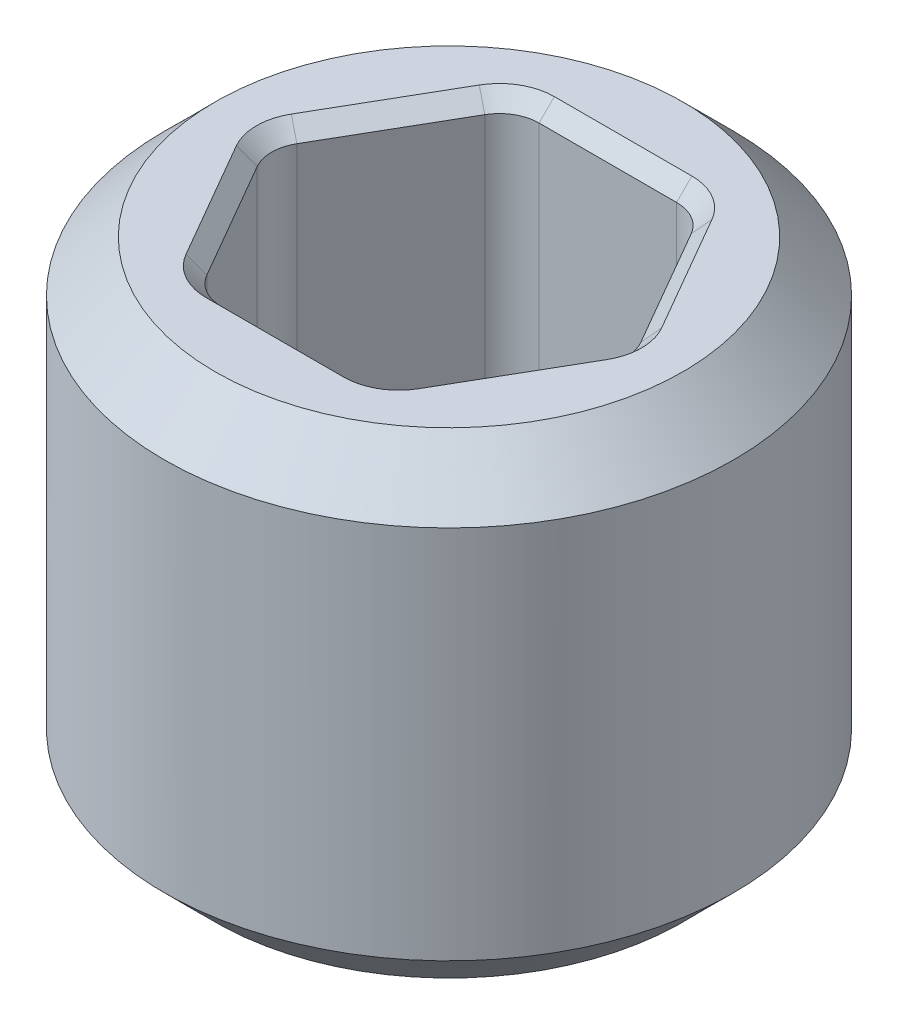
ISO-10303-21;
HEADER;
FILE_DESCRIPTION(('STEP AP214'),'2;1');
FILE_NAME('part.step','',(''),(''),'','','');
FILE_SCHEMA(('AUTOMOTIVE_DESIGN { 1 0 10303 214 1 1 1 1 }'));
ENDSEC;
DATA;
#1=APPLICATION_CONTEXT('core data for automotive mechanical design processes');
#2=APPLICATION_PROTOCOL_DEFINITION('international standard','automotive_design',2000,#1);
#3=PRODUCT_CONTEXT('',#1,'mechanical');
#4=PRODUCT('Part','Part','',(#3));
#5=PRODUCT_RELATED_PRODUCT_CATEGORY('part','',(#4));
#6=PRODUCT_DEFINITION_FORMATION('','',#4);
#7=PRODUCT_DEFINITION_CONTEXT('part definition',#1,'design');
#8=PRODUCT_DEFINITION('design','',#6,#7);
#9=PRODUCT_DEFINITION_SHAPE('','',#8);
#10=(LENGTH_UNIT() NAMED_UNIT(*) SI_UNIT(.MILLI.,.METRE.));
#11=(NAMED_UNIT(*) PLANE_ANGLE_UNIT() SI_UNIT($,.RADIAN.));
#12=(NAMED_UNIT(*) SI_UNIT($,.STERADIAN.) SOLID_ANGLE_UNIT());
#13=UNCERTAINTY_MEASURE_WITH_UNIT(LENGTH_MEASURE(1.E-05),#10,'distance_accuracy_value','');
#14=(GEOMETRIC_REPRESENTATION_CONTEXT(3) GLOBAL_UNCERTAINTY_ASSIGNED_CONTEXT((#13)) GLOBAL_UNIT_ASSIGNED_CONTEXT((#10,
#11,#12)) REPRESENTATION_CONTEXT('',''));
#15=CARTESIAN_POINT('',(0.,0.,0.));
#16=DIRECTION('',(0.,0.,1.));
#17=DIRECTION('',(1.,0.,0.));
#18=AXIS2_PLACEMENT_3D('',#15,#16,#17);
#19=CARTESIAN_POINT('',(0.,-1.190625,0.));
#20=DIRECTION('',(0.,-1.,0.));
#21=DIRECTION('',(0.,0.,-1.));
#22=AXIS2_PLACEMENT_3D('',#19,#20,#21);
#23=PLANE('',#22);
#24=CARTESIAN_POINT('',(0.343703832126949,-1.190625,0.5953125));
#25=DIRECTION('',(0.,-1.,0.));
#26=DIRECTION('',(0.,0.,-1.));
#27=AXIS2_PLACEMENT_3D('',#24,#25,#26);
#28=CIRCLE('',#27,0.274637500000001);
#29=CARTESIAN_POINT('',(0.343703832126949,-1.190625,0.869950000000001));
#30=VERTEX_POINT('',#29);
#31=CARTESIAN_POINT('',(0.581546883958799,-1.190625,0.73263125));
#32=VERTEX_POINT('',#31);
#33=EDGE_CURVE('E429',#30,#32,#28,.F.);
#34=ORIENTED_EDGE('',*,*,#33,.T.);
#35=DIRECTION('',(0.499999999999999,0.,-0.866025403784439));
#36=VECTOR('',#35,1.);
#37=CARTESIAN_POINT('',(0.925250716085747,-1.190625,0.137318749999999));
#38=LINE('',#37,#36);
#39=CARTESIAN_POINT('',(0.925250716085747,-1.190625,0.13731875));
#40=VERTEX_POINT('',#39);
#41=EDGE_CURVE('E433',#32,#40,#38,.T.);
#42=ORIENTED_EDGE('',*,*,#41,.T.);
#43=CARTESIAN_POINT('',(0.687407664253898,-1.190625,0.));
#44=DIRECTION('',(0.,-1.,0.));
#45=DIRECTION('',(0.,0.,-1.));
#46=AXIS2_PLACEMENT_3D('',#43,#44,#45);
#47=CIRCLE('',#46,0.274637500000001);
#48=CARTESIAN_POINT('',(0.925250716085747,-1.190625,-0.137318750000001));
#49=VERTEX_POINT('',#48);
#50=EDGE_CURVE('E431',#40,#49,#47,.F.);
#51=ORIENTED_EDGE('',*,*,#50,.T.);
#52=DIRECTION('',(-0.5,0.,-0.866025403784439));
#53=VECTOR('',#52,1.);
#54=CARTESIAN_POINT('',(0.581546883958798,-1.190625,-0.732631250000001));
#55=LINE('',#54,#53);
#56=CARTESIAN_POINT('',(0.581546883958798,-1.190625,-0.732631250000001));
#57=VERTEX_POINT('',#56);
#58=EDGE_CURVE('E427',#49,#57,#55,.T.);
#59=ORIENTED_EDGE('',*,*,#58,.T.);
#60=CARTESIAN_POINT('',(0.343703832126949,-1.190625,-0.5953125));
#61=DIRECTION('',(0.,-1.,0.));
#62=DIRECTION('',(0.,0.,-1.));
#63=AXIS2_PLACEMENT_3D('',#60,#61,#62);
#64=CIRCLE('',#63,0.274637500000001);
#65=CARTESIAN_POINT('',(0.343703832126949,-1.190625,-0.869950000000001));
#66=VERTEX_POINT('',#65);
#67=EDGE_CURVE('E419',#57,#66,#64,.F.);
#68=ORIENTED_EDGE('',*,*,#67,.T.);
#69=DIRECTION('',(-1.,0.,0.));
#70=VECTOR('',#69,1.);
#71=CARTESIAN_POINT('',(-0.343703832126949,-1.190625,-0.869950000000001));
#72=LINE('',#71,#70);
#73=CARTESIAN_POINT('',(-0.343703832126949,-1.190625,-0.869950000000001));
#74=VERTEX_POINT('',#73);
#75=EDGE_CURVE('E201',#66,#74,#72,.T.);
#76=ORIENTED_EDGE('',*,*,#75,.T.);
#77=CARTESIAN_POINT('',(-0.343703832126949,-1.190625,-0.5953125));
#78=DIRECTION('',(0.,-1.,0.));
#79=DIRECTION('',(0.,0.,-1.));
#80=AXIS2_PLACEMENT_3D('',#77,#78,#79);
#81=CIRCLE('',#80,0.274637500000001);
#82=CARTESIAN_POINT('',(-0.581546883958799,-1.190625,-0.73263125));
#83=VERTEX_POINT('',#82);
#84=EDGE_CURVE('E195',#74,#83,#81,.F.);
#85=ORIENTED_EDGE('',*,*,#84,.T.);
#86=DIRECTION('',(-0.499999999999999,0.,0.866025403784439));
#87=VECTOR('',#86,1.);
#88=CARTESIAN_POINT('',(-0.925250716085747,-1.190625,-0.13731875));
#89=LINE('',#88,#87);
#90=CARTESIAN_POINT('',(-0.925250716085747,-1.190625,-0.13731875));
#91=VERTEX_POINT('',#90);
#92=EDGE_CURVE('E198',#83,#91,#89,.T.);
#93=ORIENTED_EDGE('',*,*,#92,.T.);
#94=CARTESIAN_POINT('',(-0.687407664253898,-1.190625,0.));
#95=DIRECTION('',(0.,-1.,0.));
#96=DIRECTION('',(0.,0.,-1.));
#97=AXIS2_PLACEMENT_3D('',#94,#95,#96);
#98=CIRCLE('',#97,0.274637500000001);
#99=CARTESIAN_POINT('',(-0.925250716085747,-1.190625,0.137318750000001));
#100=VERTEX_POINT('',#99);
#101=EDGE_CURVE('E207',#91,#100,#98,.F.);
#102=ORIENTED_EDGE('',*,*,#101,.T.);
#103=DIRECTION('',(0.500000000000001,0.,0.866025403784438));
#104=VECTOR('',#103,1.);
#105=CARTESIAN_POINT('',(-0.581546883958798,-1.190625,0.732631250000001));
#106=LINE('',#105,#104);
#107=CARTESIAN_POINT('',(-0.581546883958798,-1.190625,0.732631250000001));
#108=VERTEX_POINT('',#107);
#109=EDGE_CURVE('E206',#100,#108,#106,.T.);
#110=ORIENTED_EDGE('',*,*,#109,.T.);
#111=CARTESIAN_POINT('',(-0.343703832126948,-1.190625,0.5953125));
#112=DIRECTION('',(0.,-1.,0.));
#113=DIRECTION('',(0.,0.,-1.));
#114=AXIS2_PLACEMENT_3D('',#111,#112,#113);
#115=CIRCLE('',#114,0.274637500000001);
#116=CARTESIAN_POINT('',(-0.343703832126948,-1.190625,0.869950000000001));
#117=VERTEX_POINT('',#116);
#118=EDGE_CURVE('E417',#108,#117,#115,.F.);
#119=ORIENTED_EDGE('',*,*,#118,.T.);
#120=DIRECTION('',(1.,0.,0.));
#121=VECTOR('',#120,1.);
#122=CARTESIAN_POINT('',(0.343703832126949,-1.190625,0.869950000000001));
#123=LINE('',#122,#121);
#124=EDGE_CURVE('E421',#117,#30,#123,.T.);
#125=ORIENTED_EDGE('',*,*,#124,.T.);
#126=EDGE_LOOP('',(#34,#42,#51,#59,#68,#76,#85,#93,#102,#110,#119,#125));
#127=FACE_BOUND('',#126,.T.);
#128=CARTESIAN_POINT('',(0.,-1.190625,0.));
#129=DIRECTION('',(0.,-1.,0.));
#130=DIRECTION('',(0.,0.,-1.));
#131=AXIS2_PLACEMENT_3D('',#128,#129,#130);
#132=CIRCLE('',#131,1.1684);
#133=CARTESIAN_POINT('',(0.,-1.190625,-1.1684));
#134=VERTEX_POINT('',#133);
#135=EDGE_CURVE('E463',#134,#134,#132,.T.);
#136=ORIENTED_EDGE('',*,*,#135,.T.);
#137=EDGE_LOOP('',(#136));
#138=FACE_BOUND('',#137,.T.);
#139=ADVANCED_FACE('F33',(#127,#138),#23,.T.);
#140=CARTESIAN_POINT('',(0.,-1.70416602917091,0.));
#141=DIRECTION('',(0.,-1.,0.));
#142=DIRECTION('',(0.,0.,-1.));
#143=AXIS2_PLACEMENT_3D('',#140,#141,#142);
#144=CYLINDRICAL_SURFACE('',#143,1.4224);
#145=CARTESIAN_POINT('',(0.,-0.936625000000001,0.));
#146=DIRECTION('',(0.,-1.,0.));
#147=DIRECTION('',(0.,0.,-1.));
#148=AXIS2_PLACEMENT_3D('',#145,#146,#147);
#149=CIRCLE('',#148,1.4224);
#150=CARTESIAN_POINT('',(0.,-0.936625000000001,-1.4224));
#151=VERTEX_POINT('',#150);
#152=EDGE_CURVE('E469',#151,#151,#149,.F.);
#153=ORIENTED_EDGE('',*,*,#152,.T.);
#154=EDGE_LOOP('',(#153));
#155=FACE_BOUND('',#154,.T.);
#156=CARTESIAN_POINT('',(0.,0.936625000000001,0.));
#157=DIRECTION('',(0.,1.,0.));
#158=DIRECTION('',(0.,0.,1.));
#159=AXIS2_PLACEMENT_3D('',#156,#157,#158);
#160=CIRCLE('',#159,1.4224);
#161=CARTESIAN_POINT('',(0.,0.936625000000001,1.4224));
#162=VERTEX_POINT('',#161);
#163=EDGE_CURVE('E466',#162,#162,#160,.F.);
#164=ORIENTED_EDGE('',*,*,#163,.T.);
#165=EDGE_LOOP('',(#164));
#166=FACE_BOUND('',#165,.T.);
#167=ADVANCED_FACE('F552',(#155,#166),#144,.T.);
#168=CARTESIAN_POINT('',(1.4224,1.190625,0.));
#169=DIRECTION('',(0.,1.,0.));
#170=DIRECTION('',(0.,0.,1.));
#171=AXIS2_PLACEMENT_3D('',#168,#169,#170);
#172=PLANE('',#171);
#173=CARTESIAN_POINT('',(0.343703832126949,1.190625,-0.5953125));
#174=DIRECTION('',(0.,1.,0.));
#175=DIRECTION('',(0.,0.,1.));
#176=AXIS2_PLACEMENT_3D('',#173,#174,#175);
#177=CIRCLE('',#176,0.274637500000001);
#178=CARTESIAN_POINT('',(0.343703832126949,1.190625,-0.86995));
#179=VERTEX_POINT('',#178);
#180=CARTESIAN_POINT('',(0.581546883958798,1.190625,-0.73263125));
#181=VERTEX_POINT('',#180);
#182=EDGE_CURVE('E42',#179,#181,#177,.F.);
#183=ORIENTED_EDGE('',*,*,#182,.T.);
#184=DIRECTION('',(0.5,0.,0.866025403784439));
#185=VECTOR('',#184,1.);
#186=CARTESIAN_POINT('',(0.925250716085747,1.190625,-0.137318750000001));
#187=LINE('',#186,#185);
#188=CARTESIAN_POINT('',(0.925250716085747,1.190625,-0.137318750000001));
#189=VERTEX_POINT('',#188);
#190=EDGE_CURVE('E11',#181,#189,#187,.T.);
#191=ORIENTED_EDGE('',*,*,#190,.T.);
#192=CARTESIAN_POINT('',(0.687407664253898,1.190625,0.));
#193=DIRECTION('',(0.,1.,0.));
#194=DIRECTION('',(0.,0.,1.));
#195=AXIS2_PLACEMENT_3D('',#192,#193,#194);
#196=CIRCLE('',#195,0.2746375);
#197=CARTESIAN_POINT('',(0.925250716085747,1.190625,0.137318749999999));
#198=VERTEX_POINT('',#197);
#199=EDGE_CURVE('E345',#189,#198,#196,.F.);
#200=ORIENTED_EDGE('',*,*,#199,.T.);
#201=DIRECTION('',(-0.499999999999999,0.,0.866025403784439));
#202=VECTOR('',#201,1.);
#203=CARTESIAN_POINT('',(0.581546883958798,1.190625,0.73263125));
#204=LINE('',#203,#202);
#205=CARTESIAN_POINT('',(0.581546883958798,1.190625,0.73263125));
#206=VERTEX_POINT('',#205);
#207=EDGE_CURVE('E341',#198,#206,#204,.T.);
#208=ORIENTED_EDGE('',*,*,#207,.T.);
#209=CARTESIAN_POINT('',(0.343703832126949,1.190625,0.5953125));
#210=DIRECTION('',(0.,1.,0.));
#211=DIRECTION('',(0.,0.,1.));
#212=AXIS2_PLACEMENT_3D('',#209,#210,#211);
#213=CIRCLE('',#212,0.2746375);
#214=CARTESIAN_POINT('',(0.343703832126949,1.190625,0.86995));
#215=VERTEX_POINT('',#214);
#216=EDGE_CURVE('E337',#206,#215,#213,.F.);
#217=ORIENTED_EDGE('',*,*,#216,.T.);
#218=DIRECTION('',(-1.,0.,0.));
#219=VECTOR('',#218,1.);
#220=CARTESIAN_POINT('',(-0.343703832126948,1.190625,0.86995));
#221=LINE('',#220,#219);
#222=CARTESIAN_POINT('',(-0.343703832126948,1.190625,0.869950000000001));
#223=VERTEX_POINT('',#222);
#224=EDGE_CURVE('E333',#215,#223,#221,.T.);
#225=ORIENTED_EDGE('',*,*,#224,.T.);
#226=CARTESIAN_POINT('',(-0.343703832126948,1.190625,0.5953125));
#227=DIRECTION('',(0.,1.,0.));
#228=DIRECTION('',(0.,0.,1.));
#229=AXIS2_PLACEMENT_3D('',#226,#227,#228);
#230=CIRCLE('',#229,0.2746375);
#231=CARTESIAN_POINT('',(-0.581546883958797,1.190625,0.73263125));
#232=VERTEX_POINT('',#231);
#233=EDGE_CURVE('E329',#223,#232,#230,.F.);
#234=ORIENTED_EDGE('',*,*,#233,.T.);
#235=DIRECTION('',(-0.500000000000001,0.,-0.866025403784438));
#236=VECTOR('',#235,1.);
#237=CARTESIAN_POINT('',(-0.925250716085746,1.190625,0.137318750000001));
#238=LINE('',#237,#236);
#239=CARTESIAN_POINT('',(-0.925250716085746,1.190625,0.137318750000001));
#240=VERTEX_POINT('',#239);
#241=EDGE_CURVE('E327',#232,#240,#238,.T.);
#242=ORIENTED_EDGE('',*,*,#241,.T.);
#243=CARTESIAN_POINT('',(-0.687407664253898,1.190625,0.));
#244=DIRECTION('',(0.,1.,0.));
#245=DIRECTION('',(0.,0.,1.));
#246=AXIS2_PLACEMENT_3D('',#243,#244,#245);
#247=CIRCLE('',#246,0.2746375);
#248=CARTESIAN_POINT('',(-0.925250716085747,1.190625,-0.13731875));
#249=VERTEX_POINT('',#248);
#250=EDGE_CURVE('E331',#240,#249,#247,.F.);
#251=ORIENTED_EDGE('',*,*,#250,.T.);
#252=DIRECTION('',(0.499999999999999,0.,-0.866025403784439));
#253=VECTOR('',#252,1.);
#254=CARTESIAN_POINT('',(-0.581546883958799,1.190625,-0.73263125));
#255=LINE('',#254,#253);
#256=CARTESIAN_POINT('',(-0.581546883958799,1.190625,-0.73263125));
#257=VERTEX_POINT('',#256);
#258=EDGE_CURVE('E335',#249,#257,#255,.T.);
#259=ORIENTED_EDGE('',*,*,#258,.T.);
#260=CARTESIAN_POINT('',(-0.343703832126949,1.190625,-0.5953125));
#261=DIRECTION('',(0.,1.,0.));
#262=DIRECTION('',(0.,0.,1.));
#263=AXIS2_PLACEMENT_3D('',#260,#261,#262);
#264=CIRCLE('',#263,0.2746375);
#265=CARTESIAN_POINT('',(-0.343703832126949,1.190625,-0.869950000000001));
#266=VERTEX_POINT('',#265);
#267=EDGE_CURVE('E339',#257,#266,#264,.F.);
#268=ORIENTED_EDGE('',*,*,#267,.T.);
#269=DIRECTION('',(1.,0.,0.));
#270=VECTOR('',#269,1.);
#271=CARTESIAN_POINT('',(0.343703832126949,1.190625,-0.86995));
#272=LINE('',#271,#270);
#273=EDGE_CURVE('E343',#266,#179,#272,.T.);
#274=ORIENTED_EDGE('',*,*,#273,.T.);
#275=EDGE_LOOP('',(#183,#191,#200,#208,#217,#225,#234,#242,#251,#259,#268,#274));
#276=FACE_BOUND('',#275,.T.);
#277=CARTESIAN_POINT('',(0.,1.190625,0.));
#278=DIRECTION('',(0.,1.,0.));
#279=DIRECTION('',(0.,0.,1.));
#280=AXIS2_PLACEMENT_3D('',#277,#278,#279);
#281=CIRCLE('',#280,1.1684);
#282=CARTESIAN_POINT('',(0.,1.190625,1.1684));
#283=VERTEX_POINT('',#282);
#284=EDGE_CURVE('E218',#283,#283,#281,.T.);
#285=ORIENTED_EDGE('',*,*,#284,.T.);
#286=EDGE_LOOP('',(#285));
#287=FACE_BOUND('',#286,.T.);
#288=ADVANCED_FACE('F347',(#276,#287),#172,.T.);
#289=CARTESIAN_POINT('',(0.91654355233853,-1.190625,0.));
#290=DIRECTION('',(0.866025403784438,0.,-0.5));
#291=DIRECTION('',(-0.5,0.,-0.866025403784438));
#292=AXIS2_PLACEMENT_3D('',#289,#290,#291);
#293=PLANE('',#292);
#294=DIRECTION('',(0.,1.,0.));
#295=VECTOR('',#294,1.);
#296=CARTESIAN_POINT('',(0.515555748190423,-1.190625,-0.69453125));
#297=LINE('',#296,#295);
#298=CARTESIAN_POINT('',(0.515555748190423,1.114425,-0.69453125));
#299=VERTEX_POINT('',#298);
#300=CARTESIAN_POINT('',(0.515555748190423,-1.114425,-0.69453125));
#301=VERTEX_POINT('',#300);
#302=EDGE_CURVE('E224',#299,#301,#297,.F.);
#303=ORIENTED_EDGE('',*,*,#302,.T.);
#304=DIRECTION('',(0.5,0.,0.866025403784438));
#305=VECTOR('',#304,1.);
#306=CARTESIAN_POINT('',(0.859259580317372,-1.114425,-0.0992187500000005));
#307=LINE('',#306,#305);
#308=CARTESIAN_POINT('',(0.859259580317372,-1.114425,-0.0992187500000006));
#309=VERTEX_POINT('',#308);
#310=EDGE_CURVE('E379',#301,#309,#307,.T.);
#311=ORIENTED_EDGE('',*,*,#310,.T.);
#312=DIRECTION('',(0.,1.,0.));
#313=VECTOR('',#312,1.);
#314=CARTESIAN_POINT('',(0.859259580317372,1.190625,-0.0992187500000006));
#315=LINE('',#314,#313);
#316=CARTESIAN_POINT('',(0.859259580317372,1.114425,-0.0992187500000006));
#317=VERTEX_POINT('',#316);
#318=EDGE_CURVE('E447',#309,#317,#315,.T.);
#319=ORIENTED_EDGE('',*,*,#318,.T.);
#320=DIRECTION('',(-0.5,0.,-0.866025403784438));
#321=VECTOR('',#320,1.);
#322=CARTESIAN_POINT('',(0.515555748190423,1.114425,-0.69453125));
#323=LINE('',#322,#321);
#324=EDGE_CURVE('E376',#317,#299,#323,.T.);
#325=ORIENTED_EDGE('',*,*,#324,.T.);
#326=EDGE_LOOP('',(#303,#311,#319,#325));
#327=FACE_BOUND('',#326,.T.);
#328=ADVANCED_FACE('F531',(#327),#293,.F.);
#329=CARTESIAN_POINT('',(0.458271776169266,-1.190625,0.79375));
#330=DIRECTION('',(0.866025403784439,0.,0.499999999999999));
#331=DIRECTION('',(0.499999999999999,0.,-0.866025403784439));
#332=AXIS2_PLACEMENT_3D('',#329,#330,#331);
#333=PLANE('',#332);
#334=DIRECTION('',(0.,1.,0.));
#335=VECTOR('',#334,1.);
#336=CARTESIAN_POINT('',(0.859259580317372,-1.190625,0.0992187499999992));
#337=LINE('',#336,#335);
#338=CARTESIAN_POINT('',(0.859259580317372,1.114425,0.0992187499999992));
#339=VERTEX_POINT('',#338);
#340=CARTESIAN_POINT('',(0.859259580317372,-1.114425,0.0992187499999992));
#341=VERTEX_POINT('',#340);
#342=EDGE_CURVE('E439',#339,#341,#337,.F.);
#343=ORIENTED_EDGE('',*,*,#342,.T.);
#344=DIRECTION('',(-0.499999999999999,0.,0.866025403784439));
#345=VECTOR('',#344,1.);
#346=CARTESIAN_POINT('',(0.515555748190424,-1.114425,0.69453125));
#347=LINE('',#346,#345);
#348=CARTESIAN_POINT('',(0.515555748190424,-1.114425,0.69453125));
#349=VERTEX_POINT('',#348);
#350=EDGE_CURVE('E364',#341,#349,#347,.T.);
#351=ORIENTED_EDGE('',*,*,#350,.T.);
#352=DIRECTION('',(0.,1.,0.));
#353=VECTOR('',#352,1.);
#354=CARTESIAN_POINT('',(0.515555748190424,1.190625,0.69453125));
#355=LINE('',#354,#353);
#356=CARTESIAN_POINT('',(0.515555748190424,1.114425,0.69453125));
#357=VERTEX_POINT('',#356);
#358=EDGE_CURVE('E441',#349,#357,#355,.T.);
#359=ORIENTED_EDGE('',*,*,#358,.T.);
#360=DIRECTION('',(0.499999999999999,0.,-0.866025403784439));
#361=VECTOR('',#360,1.);
#362=CARTESIAN_POINT('',(0.859259580317372,1.114425,0.0992187499999991));
#363=LINE('',#362,#361);
#364=EDGE_CURVE('E369',#357,#339,#363,.T.);
#365=ORIENTED_EDGE('',*,*,#364,.T.);
#366=EDGE_LOOP('',(#343,#351,#359,#365));
#367=FACE_BOUND('',#366,.T.);
#368=ADVANCED_FACE('F438',(#367),#333,.F.);
#369=CARTESIAN_POINT('',(-0.458271776169265,-1.190625,0.79375));
#370=DIRECTION('',(0.,0.,1.));
#371=DIRECTION('',(1.,0.,0.));
#372=AXIS2_PLACEMENT_3D('',#369,#370,#371);
#373=PLANE('',#372);
#374=DIRECTION('',(0.,1.,0.));
#375=VECTOR('',#374,1.);
#376=CARTESIAN_POINT('',(0.343703832126949,-1.190625,0.79375));
#377=LINE('',#376,#375);
#378=CARTESIAN_POINT('',(0.343703832126949,1.114425,0.79375));
#379=VERTEX_POINT('',#378);
#380=CARTESIAN_POINT('',(0.343703832126949,-1.114425,0.79375));
#381=VERTEX_POINT('',#380);
#382=EDGE_CURVE('E445',#379,#381,#377,.F.);
#383=ORIENTED_EDGE('',*,*,#382,.T.);
#384=DIRECTION('',(-1.,0.,0.));
#385=VECTOR('',#384,1.);
#386=CARTESIAN_POINT('',(-0.343703832126948,-1.114425,0.79375));
#387=LINE('',#386,#385);
#388=CARTESIAN_POINT('',(-0.343703832126948,-1.114425,0.79375));
#389=VERTEX_POINT('',#388);
#390=EDGE_CURVE('E383',#381,#389,#387,.T.);
#391=ORIENTED_EDGE('',*,*,#390,.T.);
#392=DIRECTION('',(0.,1.,0.));
#393=VECTOR('',#392,1.);
#394=CARTESIAN_POINT('',(-0.343703832126948,1.190625,0.79375));
#395=LINE('',#394,#393);
#396=CARTESIAN_POINT('',(-0.343703832126948,1.114425,0.79375));
#397=VERTEX_POINT('',#396);
#398=EDGE_CURVE('E398',#389,#397,#395,.T.);
#399=ORIENTED_EDGE('',*,*,#398,.T.);
#400=DIRECTION('',(1.,0.,0.));
#401=VECTOR('',#400,1.);
#402=CARTESIAN_POINT('',(0.343703832126949,1.114425,0.79375));
#403=LINE('',#402,#401);
#404=EDGE_CURVE('E381',#397,#379,#403,.T.);
#405=ORIENTED_EDGE('',*,*,#404,.T.);
#406=EDGE_LOOP('',(#383,#391,#399,#405));
#407=FACE_BOUND('',#406,.T.);
#408=ADVANCED_FACE('F503',(#407),#373,.F.);
#409=CARTESIAN_POINT('',(-0.916543552338531,-1.190625,0.));
#410=DIRECTION('',(-0.866025403784438,0.,0.500000000000001));
#411=DIRECTION('',(0.500000000000001,0.,0.866025403784438));
#412=AXIS2_PLACEMENT_3D('',#409,#410,#411);
#413=PLANE('',#412);
#414=DIRECTION('',(0.,1.,0.));
#415=VECTOR('',#414,1.);
#416=CARTESIAN_POINT('',(-0.515555748190423,-1.190625,0.69453125));
#417=LINE('',#416,#415);
#418=CARTESIAN_POINT('',(-0.515555748190423,1.114425,0.69453125));
#419=VERTEX_POINT('',#418);
#420=CARTESIAN_POINT('',(-0.515555748190423,-1.114425,0.69453125));
#421=VERTEX_POINT('',#420);
#422=EDGE_CURVE('E396',#419,#421,#417,.F.);
#423=ORIENTED_EDGE('',*,*,#422,.T.);
#424=DIRECTION('',(-0.500000000000001,0.,-0.866025403784438));
#425=VECTOR('',#424,1.);
#426=CARTESIAN_POINT('',(-0.859259580317372,-1.114425,0.0992187500000006));
#427=LINE('',#426,#425);
#428=CARTESIAN_POINT('',(-0.859259580317372,-1.114425,0.0992187500000005));
#429=VERTEX_POINT('',#428);
#430=EDGE_CURVE('E309',#421,#429,#427,.T.);
#431=ORIENTED_EDGE('',*,*,#430,.T.);
#432=DIRECTION('',(0.,1.,0.));
#433=VECTOR('',#432,1.);
#434=CARTESIAN_POINT('',(-0.859259580317372,1.190625,0.0992187500000005));
#435=LINE('',#434,#433);
#436=CARTESIAN_POINT('',(-0.859259580317372,1.114425,0.0992187500000005));
#437=VERTEX_POINT('',#436);
#438=EDGE_CURVE('E408',#429,#437,#435,.T.);
#439=ORIENTED_EDGE('',*,*,#438,.T.);
#440=DIRECTION('',(0.500000000000001,0.,0.866025403784438));
#441=VECTOR('',#440,1.);
#442=CARTESIAN_POINT('',(-0.515555748190423,1.114425,0.69453125));
#443=LINE('',#442,#441);
#444=EDGE_CURVE('E306',#437,#419,#443,.T.);
#445=ORIENTED_EDGE('',*,*,#444,.T.);
#446=EDGE_LOOP('',(#423,#431,#439,#445));
#447=FACE_BOUND('',#446,.T.);
#448=ADVANCED_FACE('F403',(#447),#413,.F.);
#449=CARTESIAN_POINT('',(-0.458271776169266,-1.190625,-0.79375));
#450=DIRECTION('',(-0.866025403784439,0.,-0.499999999999999));
#451=DIRECTION('',(-0.499999999999999,0.,0.866025403784439));
#452=AXIS2_PLACEMENT_3D('',#449,#450,#451);
#453=PLANE('',#452);
#454=DIRECTION('',(0.,1.,0.));
#455=VECTOR('',#454,1.);
#456=CARTESIAN_POINT('',(-0.859259580317372,-1.190625,-0.0992187499999994));
#457=LINE('',#456,#455);
#458=CARTESIAN_POINT('',(-0.859259580317372,1.114425,-0.0992187499999994));
#459=VERTEX_POINT('',#458);
#460=CARTESIAN_POINT('',(-0.859259580317372,-1.114425,-0.0992187499999994));
#461=VERTEX_POINT('',#460);
#462=EDGE_CURVE('E456',#459,#461,#457,.F.);
#463=ORIENTED_EDGE('',*,*,#462,.T.);
#464=DIRECTION('',(0.499999999999999,0.,-0.866025403784439));
#465=VECTOR('',#464,1.);
#466=CARTESIAN_POINT('',(-0.515555748190424,-1.114425,-0.69453125));
#467=LINE('',#466,#465);
#468=CARTESIAN_POINT('',(-0.515555748190424,-1.114425,-0.69453125));
#469=VERTEX_POINT('',#468);
#470=EDGE_CURVE('E325',#461,#469,#467,.T.);
#471=ORIENTED_EDGE('',*,*,#470,.T.);
#472=DIRECTION('',(0.,1.,0.));
#473=VECTOR('',#472,1.);
#474=CARTESIAN_POINT('',(-0.515555748190424,1.190625,-0.69453125));
#475=LINE('',#474,#473);
#476=CARTESIAN_POINT('',(-0.515555748190424,1.114425,-0.69453125));
#477=VERTEX_POINT('',#476);
#478=EDGE_CURVE('E407',#469,#477,#475,.T.);
#479=ORIENTED_EDGE('',*,*,#478,.T.);
#480=DIRECTION('',(-0.499999999999999,0.,0.866025403784439));
#481=VECTOR('',#480,1.);
#482=CARTESIAN_POINT('',(-0.859259580317372,1.114425,-0.0992187499999993));
#483=LINE('',#482,#481);
#484=EDGE_CURVE('E323',#477,#459,#483,.T.);
#485=ORIENTED_EDGE('',*,*,#484,.T.);
#486=EDGE_LOOP('',(#463,#471,#479,#485));
#487=FACE_BOUND('',#486,.T.);
#488=ADVANCED_FACE('F481',(#487),#453,.F.);
#489=CARTESIAN_POINT('',(0.458271776169265,-1.190625,-0.79375));
#490=DIRECTION('',(0.,0.,-1.));
#491=DIRECTION('',(-1.,0.,0.));
#492=AXIS2_PLACEMENT_3D('',#489,#490,#491);
#493=PLANE('',#492);
#494=DIRECTION('',(0.,1.,0.));
#495=VECTOR('',#494,1.);
#496=CARTESIAN_POINT('',(-0.343703832126949,-1.190625,-0.79375));
#497=LINE('',#496,#495);
#498=CARTESIAN_POINT('',(-0.343703832126949,1.114425,-0.79375));
#499=VERTEX_POINT('',#498);
#500=CARTESIAN_POINT('',(-0.343703832126949,-1.114425,-0.79375));
#501=VERTEX_POINT('',#500);
#502=EDGE_CURVE('E461',#499,#501,#497,.F.);
#503=ORIENTED_EDGE('',*,*,#502,.T.);
#504=DIRECTION('',(1.,0.,0.));
#505=VECTOR('',#504,1.);
#506=CARTESIAN_POINT('',(0.343703832126949,-1.114425,-0.79375));
#507=LINE('',#506,#505);
#508=CARTESIAN_POINT('',(0.343703832126949,-1.114425,-0.79375));
#509=VERTEX_POINT('',#508);
#510=EDGE_CURVE('E300',#501,#509,#507,.T.);
#511=ORIENTED_EDGE('',*,*,#510,.T.);
#512=DIRECTION('',(0.,1.,0.));
#513=VECTOR('',#512,1.);
#514=CARTESIAN_POINT('',(0.343703832126949,1.190625,-0.79375));
#515=LINE('',#514,#513);
#516=CARTESIAN_POINT('',(0.343703832126949,1.114425,-0.79375));
#517=VERTEX_POINT('',#516);
#518=EDGE_CURVE('E459',#509,#517,#515,.T.);
#519=ORIENTED_EDGE('',*,*,#518,.T.);
#520=DIRECTION('',(-1.,0.,0.));
#521=VECTOR('',#520,1.);
#522=CARTESIAN_POINT('',(-0.343703832126949,1.114425,-0.79375));
#523=LINE('',#522,#521);
#524=EDGE_CURVE('E307',#517,#499,#523,.T.);
#525=ORIENTED_EDGE('',*,*,#524,.T.);
#526=EDGE_LOOP('',(#503,#511,#519,#525));
#527=FACE_BOUND('',#526,.T.);
#528=ADVANCED_FACE('F539',(#527),#493,.F.);
#529=CARTESIAN_POINT('',(0.687407664253898,-1.190625,0.));
#530=DIRECTION('',(0.,-1.,0.));
#531=DIRECTION('',(0.,0.,-1.));
#532=AXIS2_PLACEMENT_3D('',#529,#530,#531);
#533=CYLINDRICAL_SURFACE('',#532,0.1984375);
#534=ORIENTED_EDGE('',*,*,#318,.F.);
#535=CARTESIAN_POINT('',(0.687407664253898,-1.114425,0.));
#536=DIRECTION('',(0.,-1.,0.));
#537=DIRECTION('',(0.,0.,-1.));
#538=AXIS2_PLACEMENT_3D('',#535,#536,#537);
#539=CIRCLE('',#538,0.1984375);
#540=EDGE_CURVE('E363',#309,#341,#539,.T.);
#541=ORIENTED_EDGE('',*,*,#540,.T.);
#542=ORIENTED_EDGE('',*,*,#342,.F.);
#543=CARTESIAN_POINT('',(0.687407664253898,1.114425,0.));
#544=DIRECTION('',(0.,1.,0.));
#545=DIRECTION('',(0.,0.,1.));
#546=AXIS2_PLACEMENT_3D('',#543,#544,#545);
#547=CIRCLE('',#546,0.1984375);
#548=EDGE_CURVE('E358',#339,#317,#547,.T.);
#549=ORIENTED_EDGE('',*,*,#548,.T.);
#550=EDGE_LOOP('',(#534,#541,#542,#549));
#551=FACE_BOUND('',#550,.T.);
#552=ADVANCED_FACE('F442',(#551),#533,.F.);
#553=CARTESIAN_POINT('',(0.343703832126949,-1.190625,0.5953125));
#554=DIRECTION('',(0.,-1.,0.));
#555=DIRECTION('',(0.,0.,-1.));
#556=AXIS2_PLACEMENT_3D('',#553,#554,#555);
#557=CYLINDRICAL_SURFACE('',#556,0.1984375);
#558=ORIENTED_EDGE('',*,*,#358,.F.);
#559=CARTESIAN_POINT('',(0.343703832126949,-1.114425,0.5953125));
#560=DIRECTION('',(0.,-1.,0.));
#561=DIRECTION('',(0.,0.,-1.));
#562=AXIS2_PLACEMENT_3D('',#559,#560,#561);
#563=CIRCLE('',#562,0.1984375);
#564=EDGE_CURVE('E374',#349,#381,#563,.T.);
#565=ORIENTED_EDGE('',*,*,#564,.T.);
#566=ORIENTED_EDGE('',*,*,#382,.F.);
#567=CARTESIAN_POINT('',(0.343703832126949,1.114425,0.5953125));
#568=DIRECTION('',(0.,1.,0.));
#569=DIRECTION('',(0.,0.,1.));
#570=AXIS2_PLACEMENT_3D('',#567,#568,#569);
#571=CIRCLE('',#570,0.1984375);
#572=EDGE_CURVE('E366',#379,#357,#571,.T.);
#573=ORIENTED_EDGE('',*,*,#572,.T.);
#574=EDGE_LOOP('',(#558,#565,#566,#573));
#575=FACE_BOUND('',#574,.T.);
#576=ADVANCED_FACE('F563',(#575),#557,.F.);
#577=CARTESIAN_POINT('',(-0.343703832126948,-1.190625,0.5953125));
#578=DIRECTION('',(0.,-1.,0.));
#579=DIRECTION('',(0.,0.,-1.));
#580=AXIS2_PLACEMENT_3D('',#577,#578,#579);
#581=CYLINDRICAL_SURFACE('',#580,0.1984375);
#582=ORIENTED_EDGE('',*,*,#398,.F.);
#583=CARTESIAN_POINT('',(-0.343703832126948,-1.114425,0.5953125));
#584=DIRECTION('',(0.,-1.,0.));
#585=DIRECTION('',(0.,0.,-1.));
#586=AXIS2_PLACEMENT_3D('',#583,#584,#585);
#587=CIRCLE('',#586,0.1984375);
#588=EDGE_CURVE('E311',#389,#421,#587,.T.);
#589=ORIENTED_EDGE('',*,*,#588,.T.);
#590=ORIENTED_EDGE('',*,*,#422,.F.);
#591=CARTESIAN_POINT('',(-0.343703832126948,1.114425,0.5953125));
#592=DIRECTION('',(0.,1.,0.));
#593=DIRECTION('',(0.,0.,1.));
#594=AXIS2_PLACEMENT_3D('',#591,#592,#593);
#595=CIRCLE('',#594,0.1984375);
#596=EDGE_CURVE('E389',#419,#397,#595,.T.);
#597=ORIENTED_EDGE('',*,*,#596,.T.);
#598=EDGE_LOOP('',(#582,#589,#590,#597));
#599=FACE_BOUND('',#598,.T.);
#600=ADVANCED_FACE('F395',(#599),#581,.F.);
#601=CARTESIAN_POINT('',(-0.687407664253898,-1.190625,0.));
#602=DIRECTION('',(0.,-1.,0.));
#603=DIRECTION('',(0.,0.,-1.));
#604=AXIS2_PLACEMENT_3D('',#601,#602,#603);
#605=CYLINDRICAL_SURFACE('',#604,0.1984375);
#606=ORIENTED_EDGE('',*,*,#438,.F.);
#607=CARTESIAN_POINT('',(-0.687407664253898,-1.114425,0.));
#608=DIRECTION('',(0.,-1.,0.));
#609=DIRECTION('',(0.,0.,-1.));
#610=AXIS2_PLACEMENT_3D('',#607,#608,#609);
#611=CIRCLE('',#610,0.1984375);
#612=EDGE_CURVE('E321',#429,#461,#611,.T.);
#613=ORIENTED_EDGE('',*,*,#612,.T.);
#614=ORIENTED_EDGE('',*,*,#462,.F.);
#615=CARTESIAN_POINT('',(-0.687407664253898,1.114425,0.));
#616=DIRECTION('',(0.,1.,0.));
#617=DIRECTION('',(0.,0.,1.));
#618=AXIS2_PLACEMENT_3D('',#615,#616,#617);
#619=CIRCLE('',#618,0.1984375);
#620=EDGE_CURVE('E319',#459,#437,#619,.T.);
#621=ORIENTED_EDGE('',*,*,#620,.T.);
#622=EDGE_LOOP('',(#606,#613,#614,#621));
#623=FACE_BOUND('',#622,.T.);
#624=ADVANCED_FACE('F479',(#623),#605,.F.);
#625=CARTESIAN_POINT('',(-0.343703832126949,-1.190625,-0.5953125));
#626=DIRECTION('',(0.,-1.,0.));
#627=DIRECTION('',(0.,0.,-1.));
#628=AXIS2_PLACEMENT_3D('',#625,#626,#627);
#629=CYLINDRICAL_SURFACE('',#628,0.1984375);
#630=ORIENTED_EDGE('',*,*,#478,.F.);
#631=CARTESIAN_POINT('',(-0.343703832126949,-1.114425,-0.5953125));
#632=DIRECTION('',(0.,-1.,0.));
#633=DIRECTION('',(0.,0.,-1.));
#634=AXIS2_PLACEMENT_3D('',#631,#632,#633);
#635=CIRCLE('',#634,0.1984375);
#636=EDGE_CURVE('E221',#469,#501,#635,.T.);
#637=ORIENTED_EDGE('',*,*,#636,.T.);
#638=ORIENTED_EDGE('',*,*,#502,.F.);
#639=CARTESIAN_POINT('',(-0.343703832126949,1.114425,-0.5953125));
#640=DIRECTION('',(0.,1.,0.));
#641=DIRECTION('',(0.,0.,1.));
#642=AXIS2_PLACEMENT_3D('',#639,#640,#641);
#643=CIRCLE('',#642,0.1984375);
#644=EDGE_CURVE('E316',#499,#477,#643,.T.);
#645=ORIENTED_EDGE('',*,*,#644,.T.);
#646=EDGE_LOOP('',(#630,#637,#638,#645));
#647=FACE_BOUND('',#646,.T.);
#648=ADVANCED_FACE('F571',(#647),#629,.F.);
#649=CARTESIAN_POINT('',(0.343703832126949,-1.190625,-0.5953125));
#650=DIRECTION('',(0.,-1.,0.));
#651=DIRECTION('',(0.,0.,-1.));
#652=AXIS2_PLACEMENT_3D('',#649,#650,#651);
#653=CYLINDRICAL_SURFACE('',#652,0.1984375);
#654=ORIENTED_EDGE('',*,*,#518,.F.);
#655=CARTESIAN_POINT('',(0.343703832126949,-1.114425,-0.5953125));
#656=DIRECTION('',(0.,-1.,0.));
#657=DIRECTION('',(0.,0.,-1.));
#658=AXIS2_PLACEMENT_3D('',#655,#656,#657);
#659=CIRCLE('',#658,0.1984375);
#660=EDGE_CURVE('E387',#509,#301,#659,.T.);
#661=ORIENTED_EDGE('',*,*,#660,.T.);
#662=ORIENTED_EDGE('',*,*,#302,.F.);
#663=CARTESIAN_POINT('',(0.343703832126949,1.114425,-0.5953125));
#664=DIRECTION('',(0.,1.,0.));
#665=DIRECTION('',(0.,0.,1.));
#666=AXIS2_PLACEMENT_3D('',#663,#664,#665);
#667=CIRCLE('',#666,0.1984375);
#668=EDGE_CURVE('E385',#299,#517,#667,.T.);
#669=ORIENTED_EDGE('',*,*,#668,.T.);
#670=EDGE_LOOP('',(#654,#661,#662,#669));
#671=FACE_BOUND('',#670,.T.);
#672=ADVANCED_FACE('F529',(#671),#653,.F.);
#673=CARTESIAN_POINT('',(0.,-1.190625,0.));
#674=DIRECTION('',(0.,1.,0.));
#675=DIRECTION('',(0.,0.,1.));
#676=AXIS2_PLACEMENT_3D('',#673,#674,#675);
#677=CONICAL_SURFACE('',#676,1.1684,0.785398163397447);
#678=ORIENTED_EDGE('',*,*,#152,.F.);
#679=EDGE_LOOP('',(#678));
#680=FACE_BOUND('',#679,.T.);
#681=ORIENTED_EDGE('',*,*,#135,.F.);
#682=EDGE_LOOP('',(#681));
#683=FACE_BOUND('',#682,.T.);
#684=ADVANCED_FACE('F577',(#680,#683),#677,.T.);
#685=CARTESIAN_POINT('',(0.,0.936625000000001,0.));
#686=DIRECTION('',(0.,-1.,0.));
#687=DIRECTION('',(0.,0.,-1.));
#688=AXIS2_PLACEMENT_3D('',#685,#686,#687);
#689=CONICAL_SURFACE('',#688,1.4224,0.785398163397451);
#690=ORIENTED_EDGE('',*,*,#284,.F.);
#691=EDGE_LOOP('',(#690));
#692=FACE_BOUND('',#691,.T.);
#693=ORIENTED_EDGE('',*,*,#163,.F.);
#694=EDGE_LOOP('',(#693));
#695=FACE_BOUND('',#694,.T.);
#696=ADVANCED_FACE('F580',(#692,#695),#689,.T.);
#697=CARTESIAN_POINT('',(-0.753398800022273,-1.190625,-0.434975));
#698=DIRECTION('',(0.612372435695797,-0.707106781186545,0.353553390593274));
#699=DIRECTION('',(0.499999999999999,0.,-0.866025403784439));
#700=AXIS2_PLACEMENT_3D('',#697,#698,#699);
#701=PLANE('',#700);
#702=DIRECTION('',(-0.612372435695793,-0.70710678118655,-0.353553390593272));
#703=VECTOR('',#702,1.);
#704=CARTESIAN_POINT('',(-0.515555748190424,-1.114425,-0.69453125));
#705=LINE('',#704,#703);
#706=EDGE_CURVE('E213',#469,#83,#705,.T.);
#707=ORIENTED_EDGE('',*,*,#706,.F.);
#708=ORIENTED_EDGE('',*,*,#470,.F.);
#709=DIRECTION('',(0.612372435695793,0.707106781186549,0.353553390593272));
#710=VECTOR('',#709,1.);
#711=CARTESIAN_POINT('',(-0.925250716085747,-1.190625,-0.13731875));
#712=LINE('',#711,#710);
#713=EDGE_CURVE('E216',#91,#461,#712,.T.);
#714=ORIENTED_EDGE('',*,*,#713,.F.);
#715=ORIENTED_EDGE('',*,*,#92,.F.);
#716=EDGE_LOOP('',(#707,#708,#714,#715));
#717=FACE_BOUND('',#716,.T.);
#718=ADVANCED_FACE('F211',(#717),#701,.T.);
#719=CARTESIAN_POINT('',(-0.687407664253898,-1.190625,0.));
#720=DIRECTION('',(0.,-1.,0.));
#721=DIRECTION('',(0.,0.,-1.));
#722=AXIS2_PLACEMENT_3D('',#719,#720,#721);
#723=CONICAL_SURFACE('',#722,0.274637500000001,0.785398163397446);
#724=ORIENTED_EDGE('',*,*,#713,.T.);
#725=ORIENTED_EDGE('',*,*,#612,.F.);
#726=DIRECTION('',(0.612372435695793,0.707106781186549,-0.353553390593273));
#727=VECTOR('',#726,1.);
#728=CARTESIAN_POINT('',(-0.925250716085747,-1.190625,0.137318750000001));
#729=LINE('',#728,#727);
#730=EDGE_CURVE('E222',#100,#429,#729,.T.);
#731=ORIENTED_EDGE('',*,*,#730,.F.);
#732=ORIENTED_EDGE('',*,*,#101,.F.);
#733=EDGE_LOOP('',(#724,#725,#731,#732));
#734=FACE_BOUND('',#733,.T.);
#735=ADVANCED_FACE('F476',(#734),#723,.F.);
#736=CARTESIAN_POINT('',(-0.343703832126949,-1.190625,-0.5953125));
#737=DIRECTION('',(0.,-1.,0.));
#738=DIRECTION('',(0.,0.,-1.));
#739=AXIS2_PLACEMENT_3D('',#736,#737,#738);
#740=CONICAL_SURFACE('',#739,0.274637500000001,0.785398163397446);
#741=ORIENTED_EDGE('',*,*,#706,.T.);
#742=ORIENTED_EDGE('',*,*,#84,.F.);
#743=DIRECTION('',(0.,-0.707106781186549,-0.707106781186546));
#744=VECTOR('',#743,1.);
#745=CARTESIAN_POINT('',(-0.343703832126949,-1.114425,-0.79375));
#746=LINE('',#745,#744);
#747=EDGE_CURVE('E227',#501,#74,#746,.T.);
#748=ORIENTED_EDGE('',*,*,#747,.F.);
#749=ORIENTED_EDGE('',*,*,#636,.F.);
#750=EDGE_LOOP('',(#741,#742,#748,#749));
#751=FACE_BOUND('',#750,.T.);
#752=ADVANCED_FACE('F220',(#751),#740,.F.);
#753=CARTESIAN_POINT('',(-0.753398800022272,-1.190625,0.434975000000001));
#754=DIRECTION('',(0.612372435695796,-0.707106781186546,-0.353553390593275));
#755=DIRECTION('',(-0.500000000000001,0.,-0.866025403784438));
#756=AXIS2_PLACEMENT_3D('',#753,#754,#755);
#757=PLANE('',#756);
#758=ORIENTED_EDGE('',*,*,#730,.T.);
#759=ORIENTED_EDGE('',*,*,#430,.F.);
#760=DIRECTION('',(0.612372435695792,0.707106781186549,-0.353553390593274));
#761=VECTOR('',#760,1.);
#762=CARTESIAN_POINT('',(-0.581546883958798,-1.190625,0.732631250000001));
#763=LINE('',#762,#761);
#764=EDGE_CURVE('E294',#108,#421,#763,.T.);
#765=ORIENTED_EDGE('',*,*,#764,.F.);
#766=ORIENTED_EDGE('',*,*,#109,.F.);
#767=EDGE_LOOP('',(#758,#759,#765,#766));
#768=FACE_BOUND('',#767,.T.);
#769=ADVANCED_FACE('F412',(#768),#757,.T.);
#770=CARTESIAN_POINT('',(0.,-1.190625,-0.869950000000001));
#771=DIRECTION('',(0.,-0.707106781186546,0.707106781186549));
#772=DIRECTION('',(1.,0.,0.));
#773=AXIS2_PLACEMENT_3D('',#770,#771,#772);
#774=PLANE('',#773);
#775=ORIENTED_EDGE('',*,*,#747,.T.);
#776=ORIENTED_EDGE('',*,*,#75,.F.);
#777=DIRECTION('',(0.,-0.707106781186549,-0.707106781186547));
#778=VECTOR('',#777,1.);
#779=CARTESIAN_POINT('',(0.343703832126949,-1.114425,-0.79375));
#780=LINE('',#779,#778);
#781=EDGE_CURVE('E291',#509,#66,#780,.T.);
#782=ORIENTED_EDGE('',*,*,#781,.F.);
#783=ORIENTED_EDGE('',*,*,#510,.F.);
#784=EDGE_LOOP('',(#775,#776,#782,#783));
#785=FACE_BOUND('',#784,.T.);
#786=ADVANCED_FACE('F298',(#785),#774,.T.);
#787=CARTESIAN_POINT('',(-0.343703832126948,-1.190625,0.5953125));
#788=DIRECTION('',(0.,-1.,0.));
#789=DIRECTION('',(0.,0.,-1.));
#790=AXIS2_PLACEMENT_3D('',#787,#788,#789);
#791=CONICAL_SURFACE('',#790,0.274637500000001,0.785398163397446);
#792=ORIENTED_EDGE('',*,*,#764,.T.);
#793=ORIENTED_EDGE('',*,*,#588,.F.);
#794=DIRECTION('',(0.,0.707106781186549,-0.707106781186546));
#795=VECTOR('',#794,1.);
#796=CARTESIAN_POINT('',(-0.343703832126948,-1.190625,0.869950000000001));
#797=LINE('',#796,#795);
#798=EDGE_CURVE('E288',#117,#389,#797,.T.);
#799=ORIENTED_EDGE('',*,*,#798,.F.);
#800=ORIENTED_EDGE('',*,*,#118,.F.);
#801=EDGE_LOOP('',(#792,#793,#799,#800));
#802=FACE_BOUND('',#801,.T.);
#803=ADVANCED_FACE('F416',(#802),#791,.F.);
#804=CARTESIAN_POINT('',(0.343703832126949,-1.190625,-0.5953125));
#805=DIRECTION('',(0.,-1.,0.));
#806=DIRECTION('',(0.,0.,-1.));
#807=AXIS2_PLACEMENT_3D('',#804,#805,#806);
#808=CONICAL_SURFACE('',#807,0.274637500000001,0.785398163397446);
#809=ORIENTED_EDGE('',*,*,#781,.T.);
#810=ORIENTED_EDGE('',*,*,#67,.F.);
#811=DIRECTION('',(0.612372435695793,-0.70710678118655,-0.353553390593273));
#812=VECTOR('',#811,1.);
#813=CARTESIAN_POINT('',(0.515555748190423,-1.114425,-0.69453125));
#814=LINE('',#813,#812);
#815=EDGE_CURVE('E285',#301,#57,#814,.T.);
#816=ORIENTED_EDGE('',*,*,#815,.F.);
#817=ORIENTED_EDGE('',*,*,#660,.F.);
#818=EDGE_LOOP('',(#809,#810,#816,#817));
#819=FACE_BOUND('',#818,.T.);
#820=ADVANCED_FACE('F525',(#819),#808,.F.);
#821=CARTESIAN_POINT('',(0.,-1.190625,0.869950000000001));
#822=DIRECTION('',(0.,-0.707106781186546,-0.707106781186549));
#823=DIRECTION('',(-1.,0.,0.));
#824=AXIS2_PLACEMENT_3D('',#821,#822,#823);
#825=PLANE('',#824);
#826=ORIENTED_EDGE('',*,*,#798,.T.);
#827=ORIENTED_EDGE('',*,*,#390,.F.);
#828=DIRECTION('',(0.,0.707106781186549,-0.707106781186546));
#829=VECTOR('',#828,1.);
#830=CARTESIAN_POINT('',(0.343703832126949,-1.190625,0.869950000000001));
#831=LINE('',#830,#829);
#832=EDGE_CURVE('E282',#30,#381,#831,.T.);
#833=ORIENTED_EDGE('',*,*,#832,.F.);
#834=ORIENTED_EDGE('',*,*,#124,.F.);
#835=EDGE_LOOP('',(#826,#827,#833,#834));
#836=FACE_BOUND('',#835,.T.);
#837=ADVANCED_FACE('F508',(#836),#825,.T.);
#838=CARTESIAN_POINT('',(0.753398800022273,-1.190625,-0.434975));
#839=DIRECTION('',(-0.612372435695796,-0.707106781186546,0.353553390593275));
#840=DIRECTION('',(0.5,0.,0.866025403784438));
#841=AXIS2_PLACEMENT_3D('',#838,#839,#840);
#842=PLANE('',#841);
#843=ORIENTED_EDGE('',*,*,#815,.T.);
#844=ORIENTED_EDGE('',*,*,#58,.F.);
#845=DIRECTION('',(0.612372435695793,-0.70710678118655,-0.353553390593273));
#846=VECTOR('',#845,1.);
#847=CARTESIAN_POINT('',(0.859259580317372,-1.114425,-0.0992187500000006));
#848=LINE('',#847,#846);
#849=EDGE_CURVE('E276',#309,#49,#848,.T.);
#850=ORIENTED_EDGE('',*,*,#849,.F.);
#851=ORIENTED_EDGE('',*,*,#310,.F.);
#852=EDGE_LOOP('',(#843,#844,#850,#851));
#853=FACE_BOUND('',#852,.T.);
#854=ADVANCED_FACE('F521',(#853),#842,.T.);
#855=CARTESIAN_POINT('',(0.343703832126949,-1.190625,0.5953125));
#856=DIRECTION('',(0.,-1.,0.));
#857=DIRECTION('',(0.,0.,-1.));
#858=AXIS2_PLACEMENT_3D('',#855,#856,#857);
#859=CONICAL_SURFACE('',#858,0.274637500000001,0.785398163397446);
#860=ORIENTED_EDGE('',*,*,#832,.T.);
#861=ORIENTED_EDGE('',*,*,#564,.F.);
#862=DIRECTION('',(-0.612372435695793,0.707106781186549,-0.353553390593273));
#863=VECTOR('',#862,1.);
#864=CARTESIAN_POINT('',(0.581546883958799,-1.190625,0.73263125));
#865=LINE('',#864,#863);
#866=EDGE_CURVE('E269',#32,#349,#865,.T.);
#867=ORIENTED_EDGE('',*,*,#866,.F.);
#868=ORIENTED_EDGE('',*,*,#33,.F.);
#869=EDGE_LOOP('',(#860,#861,#867,#868));
#870=FACE_BOUND('',#869,.T.);
#871=ADVANCED_FACE('F512',(#870),#859,.F.);
#872=CARTESIAN_POINT('',(0.687407664253898,-1.190625,0.));
#873=DIRECTION('',(0.,-1.,0.));
#874=DIRECTION('',(0.,0.,-1.));
#875=AXIS2_PLACEMENT_3D('',#872,#873,#874);
#876=CONICAL_SURFACE('',#875,0.274637500000001,0.785398163397446);
#877=ORIENTED_EDGE('',*,*,#849,.T.);
#878=ORIENTED_EDGE('',*,*,#50,.F.);
#879=DIRECTION('',(0.612372435695793,-0.70710678118655,0.353553390593272));
#880=VECTOR('',#879,1.);
#881=CARTESIAN_POINT('',(0.859259580317372,-1.114425,0.0992187499999993));
#882=LINE('',#881,#880);
#883=EDGE_CURVE('E264',#341,#40,#882,.T.);
#884=ORIENTED_EDGE('',*,*,#883,.F.);
#885=ORIENTED_EDGE('',*,*,#540,.F.);
#886=EDGE_LOOP('',(#877,#878,#884,#885));
#887=FACE_BOUND('',#886,.T.);
#888=ADVANCED_FACE('F517',(#887),#876,.F.);
#889=CARTESIAN_POINT('',(0.753398800022273,-1.190625,0.434974999999999));
#890=DIRECTION('',(-0.612372435695796,-0.707106781186546,-0.353553390593274));
#891=DIRECTION('',(-0.499999999999999,0.,0.866025403784439));
#892=AXIS2_PLACEMENT_3D('',#889,#890,#891);
#893=PLANE('',#892);
#894=ORIENTED_EDGE('',*,*,#866,.T.);
#895=ORIENTED_EDGE('',*,*,#350,.F.);
#896=ORIENTED_EDGE('',*,*,#883,.T.);
#897=ORIENTED_EDGE('',*,*,#41,.F.);
#898=EDGE_LOOP('',(#894,#895,#896,#897));
#899=FACE_BOUND('',#898,.T.);
#900=ADVANCED_FACE('F515',(#899),#893,.T.);
#901=CARTESIAN_POINT('',(-0.916543552338531,1.114425,0.));
#902=DIRECTION('',(0.612372435695793,0.707106781186549,-0.353553390593273));
#903=DIRECTION('',(-0.500000000000001,0.,-0.866025403784438));
#904=AXIS2_PLACEMENT_3D('',#901,#902,#903);
#905=PLANE('',#904);
#906=DIRECTION('',(0.612372435695796,-0.707106781186546,-0.353553390593275));
#907=VECTOR('',#906,1.);
#908=CARTESIAN_POINT('',(-0.925250716085746,1.190625,0.137318750000001));
#909=LINE('',#908,#907);
#910=EDGE_CURVE('E257',#240,#437,#909,.T.);
#911=ORIENTED_EDGE('',*,*,#910,.F.);
#912=ORIENTED_EDGE('',*,*,#241,.F.);
#913=DIRECTION('',(-0.612372435695795,0.707106781186546,0.353553390593275));
#914=VECTOR('',#913,1.);
#915=CARTESIAN_POINT('',(-0.515555748190423,1.114425,0.69453125));
#916=LINE('',#915,#914);
#917=EDGE_CURVE('E37',#419,#232,#916,.T.);
#918=ORIENTED_EDGE('',*,*,#917,.F.);
#919=ORIENTED_EDGE('',*,*,#444,.F.);
#920=EDGE_LOOP('',(#911,#912,#918,#919));
#921=FACE_BOUND('',#920,.T.);
#922=ADVANCED_FACE('F35',(#921),#905,.T.);
#923=CARTESIAN_POINT('',(-0.343703832126948,1.190625,0.5953125));
#924=DIRECTION('',(0.,1.,0.));
#925=DIRECTION('',(0.,0.,1.));
#926=AXIS2_PLACEMENT_3D('',#923,#924,#925);
#927=CONICAL_SURFACE('',#926,0.2746375,0.785398163397454);
#928=ORIENTED_EDGE('',*,*,#917,.T.);
#929=ORIENTED_EDGE('',*,*,#233,.F.);
#930=DIRECTION('',(0.,0.707106781186543,0.707106781186552));
#931=VECTOR('',#930,1.);
#932=CARTESIAN_POINT('',(-0.343703832126948,1.114425,0.79375));
#933=LINE('',#932,#931);
#934=EDGE_CURVE('E255',#397,#223,#933,.T.);
#935=ORIENTED_EDGE('',*,*,#934,.F.);
#936=ORIENTED_EDGE('',*,*,#596,.F.);
#937=EDGE_LOOP('',(#928,#929,#935,#936));
#938=FACE_BOUND('',#937,.T.);
#939=ADVANCED_FACE('F500',(#938),#927,.F.);
#940=CARTESIAN_POINT('',(-0.687407664253898,1.190625,0.));
#941=DIRECTION('',(0.,1.,0.));
#942=DIRECTION('',(0.,0.,1.));
#943=AXIS2_PLACEMENT_3D('',#940,#941,#942);
#944=CONICAL_SURFACE('',#943,0.2746375,0.785398163397454);
#945=ORIENTED_EDGE('',*,*,#910,.T.);
#946=ORIENTED_EDGE('',*,*,#620,.F.);
#947=DIRECTION('',(0.612372435695798,-0.707106781186543,0.353553390593276));
#948=VECTOR('',#947,1.);
#949=CARTESIAN_POINT('',(-0.925250716085747,1.190625,-0.13731875));
#950=LINE('',#949,#948);
#951=EDGE_CURVE('E252',#249,#459,#950,.T.);
#952=ORIENTED_EDGE('',*,*,#951,.F.);
#953=ORIENTED_EDGE('',*,*,#250,.F.);
#954=EDGE_LOOP('',(#945,#946,#952,#953));
#955=FACE_BOUND('',#954,.T.);
#956=ADVANCED_FACE('F497',(#955),#944,.F.);
#957=CARTESIAN_POINT('',(-0.458271776169265,1.114425,0.79375));
#958=DIRECTION('',(0.,0.70710678118655,-0.707106781186545));
#959=DIRECTION('',(-1.,0.,0.));
#960=AXIS2_PLACEMENT_3D('',#957,#958,#959);
#961=PLANE('',#960);
#962=ORIENTED_EDGE('',*,*,#934,.T.);
#963=ORIENTED_EDGE('',*,*,#224,.F.);
#964=DIRECTION('',(0.,0.707106781186544,0.70710678118655));
#965=VECTOR('',#964,1.);
#966=CARTESIAN_POINT('',(0.343703832126949,1.114425,0.79375));
#967=LINE('',#966,#965);
#968=EDGE_CURVE('E249',#379,#215,#967,.T.);
#969=ORIENTED_EDGE('',*,*,#968,.F.);
#970=ORIENTED_EDGE('',*,*,#404,.F.);
#971=EDGE_LOOP('',(#962,#963,#969,#970));
#972=FACE_BOUND('',#971,.T.);
#973=ADVANCED_FACE('F661',(#972),#961,.T.);
#974=CARTESIAN_POINT('',(-0.458271776169266,1.114425,-0.79375));
#975=DIRECTION('',(0.612372435695791,0.707106781186552,0.353553390593271));
#976=DIRECTION('',(0.499999999999999,0.,-0.866025403784439));
#977=AXIS2_PLACEMENT_3D('',#974,#975,#976);
#978=PLANE('',#977);
#979=ORIENTED_EDGE('',*,*,#951,.T.);
#980=ORIENTED_EDGE('',*,*,#484,.F.);
#981=DIRECTION('',(0.6123724356958,-0.707106781186542,0.353553390593275));
#982=VECTOR('',#981,1.);
#983=CARTESIAN_POINT('',(-0.581546883958799,1.190625,-0.73263125));
#984=LINE('',#983,#982);
#985=EDGE_CURVE('E246',#257,#477,#984,.T.);
#986=ORIENTED_EDGE('',*,*,#985,.F.);
#987=ORIENTED_EDGE('',*,*,#258,.F.);
#988=EDGE_LOOP('',(#979,#980,#986,#987));
#989=FACE_BOUND('',#988,.T.);
#990=ADVANCED_FACE('F486',(#989),#978,.T.);
#991=CARTESIAN_POINT('',(0.343703832126949,1.190625,0.5953125));
#992=DIRECTION('',(0.,1.,0.));
#993=DIRECTION('',(0.,0.,1.));
#994=AXIS2_PLACEMENT_3D('',#991,#992,#993);
#995=CONICAL_SURFACE('',#994,0.2746375,0.785398163397454);
#996=ORIENTED_EDGE('',*,*,#968,.T.);
#997=ORIENTED_EDGE('',*,*,#216,.F.);
#998=DIRECTION('',(0.612372435695798,0.707106781186543,0.353553390593276));
#999=VECTOR('',#998,1.);
#1000=CARTESIAN_POINT('',(0.515555748190424,1.114425,0.69453125));
#1001=LINE('',#1000,#999);
#1002=EDGE_CURVE('E243',#357,#206,#1001,.T.);
#1003=ORIENTED_EDGE('',*,*,#1002,.F.);
#1004=ORIENTED_EDGE('',*,*,#572,.F.);
#1005=EDGE_LOOP('',(#996,#997,#1003,#1004));
#1006=FACE_BOUND('',#1005,.T.);
#1007=ADVANCED_FACE('F645',(#1006),#995,.F.);
#1008=CARTESIAN_POINT('',(-0.343703832126949,1.190625,-0.5953125));
#1009=DIRECTION('',(0.,1.,0.));
#1010=DIRECTION('',(0.,0.,1.));
#1011=AXIS2_PLACEMENT_3D('',#1008,#1009,#1010);
#1012=CONICAL_SURFACE('',#1011,0.2746375,0.785398163397454);
#1013=ORIENTED_EDGE('',*,*,#985,.T.);
#1014=ORIENTED_EDGE('',*,*,#644,.F.);
#1015=DIRECTION('',(0.,-0.707106781186543,0.707106781186552));
#1016=VECTOR('',#1015,1.);
#1017=CARTESIAN_POINT('',(-0.343703832126949,1.190625,-0.869950000000001));
#1018=LINE('',#1017,#1016);
#1019=EDGE_CURVE('E240',#266,#499,#1018,.T.);
#1020=ORIENTED_EDGE('',*,*,#1019,.F.);
#1021=ORIENTED_EDGE('',*,*,#267,.F.);
#1022=EDGE_LOOP('',(#1013,#1014,#1020,#1021));
#1023=FACE_BOUND('',#1022,.T.);
#1024=ADVANCED_FACE('F492',(#1023),#1012,.F.);
#1025=CARTESIAN_POINT('',(0.458271776169266,1.114425,0.79375));
#1026=DIRECTION('',(-0.612372435695792,0.707106781186551,-0.353553390593271));
#1027=DIRECTION('',(-0.499999999999999,0.,0.866025403784439));
#1028=AXIS2_PLACEMENT_3D('',#1025,#1026,#1027);
#1029=PLANE('',#1028);
#1030=ORIENTED_EDGE('',*,*,#1002,.T.);
#1031=ORIENTED_EDGE('',*,*,#207,.F.);
#1032=DIRECTION('',(0.612372435695797,0.707106781186544,0.353553390593275));
#1033=VECTOR('',#1032,1.);
#1034=CARTESIAN_POINT('',(0.859259580317372,1.114425,0.0992187499999993));
#1035=LINE('',#1034,#1033);
#1036=EDGE_CURVE('E237',#339,#198,#1035,.T.);
#1037=ORIENTED_EDGE('',*,*,#1036,.F.);
#1038=ORIENTED_EDGE('',*,*,#364,.F.);
#1039=EDGE_LOOP('',(#1030,#1031,#1037,#1038));
#1040=FACE_BOUND('',#1039,.T.);
#1041=ADVANCED_FACE('F353',(#1040),#1029,.T.);
#1042=CARTESIAN_POINT('',(0.458271776169265,1.114425,-0.79375));
#1043=DIRECTION('',(0.,0.70710678118655,0.707106781186544));
#1044=DIRECTION('',(1.,0.,0.));
#1045=AXIS2_PLACEMENT_3D('',#1042,#1043,#1044);
#1046=PLANE('',#1045);
#1047=ORIENTED_EDGE('',*,*,#1019,.T.);
#1048=ORIENTED_EDGE('',*,*,#524,.F.);
#1049=DIRECTION('',(0.,-0.707106781186544,0.70710678118655));
#1050=VECTOR('',#1049,1.);
#1051=CARTESIAN_POINT('',(0.343703832126949,1.190625,-0.86995));
#1052=LINE('',#1051,#1050);
#1053=EDGE_CURVE('E234',#179,#517,#1052,.T.);
#1054=ORIENTED_EDGE('',*,*,#1053,.F.);
#1055=ORIENTED_EDGE('',*,*,#273,.F.);
#1056=EDGE_LOOP('',(#1047,#1048,#1054,#1055));
#1057=FACE_BOUND('',#1056,.T.);
#1058=ADVANCED_FACE('F542',(#1057),#1046,.T.);
#1059=CARTESIAN_POINT('',(0.687407664253898,1.190625,0.));
#1060=DIRECTION('',(0.,1.,0.));
#1061=DIRECTION('',(0.,0.,1.));
#1062=AXIS2_PLACEMENT_3D('',#1059,#1060,#1061);
#1063=CONICAL_SURFACE('',#1062,0.2746375,0.785398163397454);
#1064=ORIENTED_EDGE('',*,*,#1036,.T.);
#1065=ORIENTED_EDGE('',*,*,#199,.F.);
#1066=DIRECTION('',(0.612372435695798,0.707106781186543,-0.353553390593276));
#1067=VECTOR('',#1066,1.);
#1068=CARTESIAN_POINT('',(0.859259580317372,1.114425,-0.0992187500000006));
#1069=LINE('',#1068,#1067);
#1070=EDGE_CURVE('E55',#317,#189,#1069,.T.);
#1071=ORIENTED_EDGE('',*,*,#1070,.F.);
#1072=ORIENTED_EDGE('',*,*,#548,.F.);
#1073=EDGE_LOOP('',(#1064,#1065,#1071,#1072));
#1074=FACE_BOUND('',#1073,.T.);
#1075=ADVANCED_FACE('F357',(#1074),#1063,.F.);
#1076=CARTESIAN_POINT('',(0.343703832126949,1.190625,-0.5953125));
#1077=DIRECTION('',(0.,1.,0.));
#1078=DIRECTION('',(0.,0.,1.));
#1079=AXIS2_PLACEMENT_3D('',#1076,#1077,#1078);
#1080=CONICAL_SURFACE('',#1079,0.2746375,0.785398163397454);
#1081=ORIENTED_EDGE('',*,*,#1053,.T.);
#1082=ORIENTED_EDGE('',*,*,#668,.F.);
#1083=DIRECTION('',(-0.612372435695798,-0.707106781186543,0.353553390593276));
#1084=VECTOR('',#1083,1.);
#1085=CARTESIAN_POINT('',(0.581546883958798,1.190625,-0.73263125));
#1086=LINE('',#1085,#1084);
#1087=EDGE_CURVE('E231',#181,#299,#1086,.T.);
#1088=ORIENTED_EDGE('',*,*,#1087,.F.);
#1089=ORIENTED_EDGE('',*,*,#182,.F.);
#1090=EDGE_LOOP('',(#1081,#1082,#1088,#1089));
#1091=FACE_BOUND('',#1090,.T.);
#1092=ADVANCED_FACE('F537',(#1091),#1080,.F.);
#1093=CARTESIAN_POINT('',(0.91654355233853,1.114425,0.));
#1094=DIRECTION('',(-0.612372435695792,0.70710678118655,0.353553390593272));
#1095=DIRECTION('',(0.5,0.,0.866025403784438));
#1096=AXIS2_PLACEMENT_3D('',#1093,#1094,#1095);
#1097=PLANE('',#1096);
#1098=ORIENTED_EDGE('',*,*,#1070,.T.);
#1099=ORIENTED_EDGE('',*,*,#190,.F.);
#1100=ORIENTED_EDGE('',*,*,#1087,.T.);
#1101=ORIENTED_EDGE('',*,*,#324,.F.);
#1102=EDGE_LOOP('',(#1098,#1099,#1100,#1101));
#1103=FACE_BOUND('',#1102,.T.);
#1104=ADVANCED_FACE('F533',(#1103),#1097,.T.);
#1105=CLOSED_SHELL('',(#139,#167,#288,#328,#368,#408,#448,#488,#528,#552,#576,#600,#624,#648,
#672,#684,#696,#718,#735,#752,#769,#786,#803,#820,#837,#854,#871,#888,#900,#922,#939,#956,#973,
#990,#1007,#1024,#1041,#1058,#1075,#1092,#1104));
#1106=MANIFOLD_SOLID_BREP('B2',#1105);
#1107=ADVANCED_BREP_SHAPE_REPRESENTATION('',(#18,#1106),#14);
#1108=SHAPE_DEFINITION_REPRESENTATION(#9,#1107);
ENDSEC;
END-ISO-10303-21;
